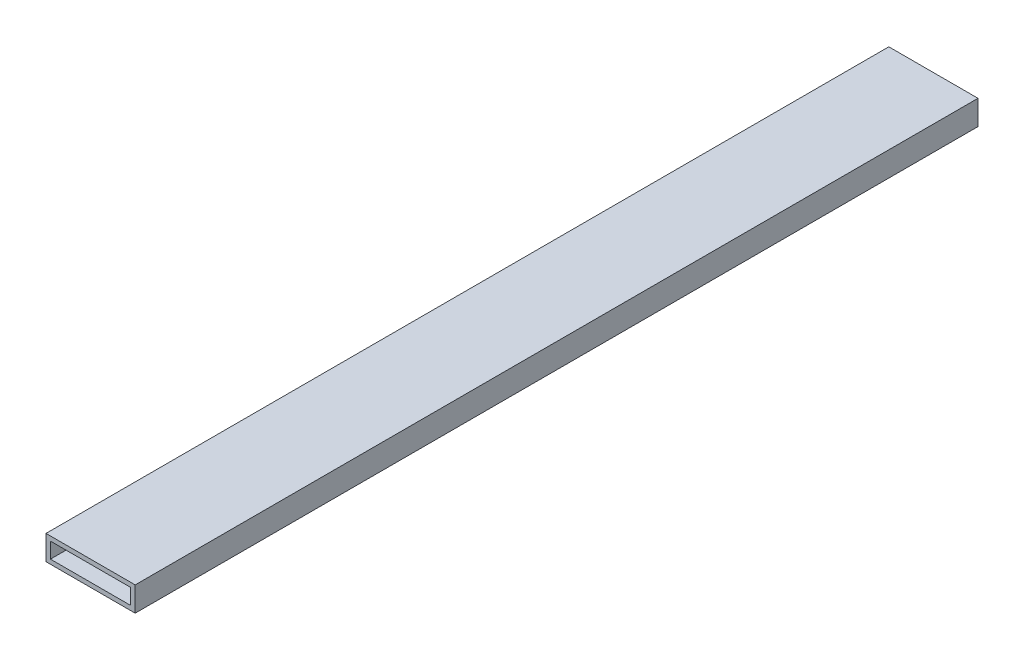
ISO-10303-21;
HEADER;
FILE_DESCRIPTION(('STEP AP214'),'2;1');
FILE_NAME('part.step','',(''),(''),'','','');
FILE_SCHEMA(('AUTOMOTIVE_DESIGN { 1 0 10303 214 1 1 1 1 }'));
ENDSEC;
DATA;
#1=APPLICATION_CONTEXT('core data for automotive mechanical design processes');
#2=APPLICATION_PROTOCOL_DEFINITION('international standard','automotive_design',2000,#1);
#3=PRODUCT_CONTEXT('',#1,'mechanical');
#4=PRODUCT('Part','Part','',(#3));
#5=PRODUCT_RELATED_PRODUCT_CATEGORY('part','',(#4));
#6=PRODUCT_DEFINITION_FORMATION('','',#4);
#7=PRODUCT_DEFINITION_CONTEXT('part definition',#1,'design');
#8=PRODUCT_DEFINITION('design','',#6,#7);
#9=PRODUCT_DEFINITION_SHAPE('','',#8);
#10=(LENGTH_UNIT() NAMED_UNIT(*) SI_UNIT(.MILLI.,.METRE.));
#11=(NAMED_UNIT(*) PLANE_ANGLE_UNIT() SI_UNIT($,.RADIAN.));
#12=(NAMED_UNIT(*) SI_UNIT($,.STERADIAN.) SOLID_ANGLE_UNIT());
#13=UNCERTAINTY_MEASURE_WITH_UNIT(LENGTH_MEASURE(1.E-05),#10,'distance_accuracy_value','');
#14=(GEOMETRIC_REPRESENTATION_CONTEXT(3) GLOBAL_UNCERTAINTY_ASSIGNED_CONTEXT((#13)) GLOBAL_UNIT_ASSIGNED_CONTEXT((#10,
#11,#12)) REPRESENTATION_CONTEXT('',''));
#15=CARTESIAN_POINT('',(0.,0.,0.));
#16=DIRECTION('',(0.,0.,1.));
#17=DIRECTION('',(1.,0.,0.));
#18=AXIS2_PLACEMENT_3D('',#15,#16,#17);
#19=CARTESIAN_POINT('',(0.,0.,378.));
#20=DIRECTION('',(0.,0.,-1.));
#21=DIRECTION('',(-1.,0.,0.));
#22=AXIS2_PLACEMENT_3D('',#19,#20,#21);
#23=PLANE('',#22);
#24=DIRECTION('',(0.,1.,0.));
#25=VECTOR('',#24,1.);
#26=CARTESIAN_POINT('',(20.,-5.5,378.));
#27=LINE('',#26,#25);
#28=CARTESIAN_POINT('',(20.,-5.5,378.));
#29=VERTEX_POINT('',#28);
#30=CARTESIAN_POINT('',(20.,5.5,378.));
#31=VERTEX_POINT('',#30);
#32=EDGE_CURVE('E153',#29,#31,#27,.T.);
#33=ORIENTED_EDGE('',*,*,#32,.T.);
#34=DIRECTION('',(-1.,0.,0.));
#35=VECTOR('',#34,1.);
#36=CARTESIAN_POINT('',(-20.,5.5,378.));
#37=LINE('',#36,#35);
#38=CARTESIAN_POINT('',(-20.,5.5,378.));
#39=VERTEX_POINT('',#38);
#40=EDGE_CURVE('E157',#31,#39,#37,.T.);
#41=ORIENTED_EDGE('',*,*,#40,.T.);
#42=DIRECTION('',(0.,-1.,0.));
#43=VECTOR('',#42,1.);
#44=CARTESIAN_POINT('',(-20.,-5.5,378.));
#45=LINE('',#44,#43);
#46=CARTESIAN_POINT('',(-20.,-5.5,378.));
#47=VERTEX_POINT('',#46);
#48=EDGE_CURVE('E161',#39,#47,#45,.T.);
#49=ORIENTED_EDGE('',*,*,#48,.T.);
#50=DIRECTION('',(1.,0.,0.));
#51=VECTOR('',#50,1.);
#52=CARTESIAN_POINT('',(-20.,-5.5,378.));
#53=LINE('',#52,#51);
#54=EDGE_CURVE('E164',#47,#29,#53,.T.);
#55=ORIENTED_EDGE('',*,*,#54,.T.);
#56=EDGE_LOOP('',(#33,#41,#49,#55));
#57=FACE_BOUND('',#56,.T.);
#58=DIRECTION('',(0.,-1.,0.));
#59=VECTOR('',#58,1.);
#60=CARTESIAN_POINT('',(-18.,-3.5,378.));
#61=LINE('',#60,#59);
#62=CARTESIAN_POINT('',(-18.,3.5,378.));
#63=VERTEX_POINT('',#62);
#64=CARTESIAN_POINT('',(-18.,-3.5,378.));
#65=VERTEX_POINT('',#64);
#66=EDGE_CURVE('E105',#63,#65,#61,.T.);
#67=ORIENTED_EDGE('',*,*,#66,.F.);
#68=DIRECTION('',(-1.,0.,0.));
#69=VECTOR('',#68,1.);
#70=CARTESIAN_POINT('',(-18.,3.5,378.));
#71=LINE('',#70,#69);
#72=CARTESIAN_POINT('',(18.,3.5,378.));
#73=VERTEX_POINT('',#72);
#74=EDGE_CURVE('E131',#73,#63,#71,.T.);
#75=ORIENTED_EDGE('',*,*,#74,.F.);
#76=DIRECTION('',(0.,1.,0.));
#77=VECTOR('',#76,1.);
#78=CARTESIAN_POINT('',(18.,-3.5,378.));
#79=LINE('',#78,#77);
#80=CARTESIAN_POINT('',(18.,-3.5,378.));
#81=VERTEX_POINT('',#80);
#82=EDGE_CURVE('E127',#81,#73,#79,.T.);
#83=ORIENTED_EDGE('',*,*,#82,.F.);
#84=DIRECTION('',(1.,0.,0.));
#85=VECTOR('',#84,1.);
#86=CARTESIAN_POINT('',(-18.,-3.5,378.));
#87=LINE('',#86,#85);
#88=EDGE_CURVE('E114',#65,#81,#87,.T.);
#89=ORIENTED_EDGE('',*,*,#88,.F.);
#90=EDGE_LOOP('',(#67,#75,#83,#89));
#91=FACE_BOUND('',#90,.T.);
#92=ADVANCED_FACE('F39',(#57,#91),#23,.F.);
#93=CARTESIAN_POINT('',(0.,0.,0.));
#94=DIRECTION('',(0.,0.,-1.));
#95=DIRECTION('',(-1.,0.,0.));
#96=AXIS2_PLACEMENT_3D('',#93,#94,#95);
#97=PLANE('',#96);
#98=DIRECTION('',(0.,1.,0.));
#99=VECTOR('',#98,1.);
#100=CARTESIAN_POINT('',(20.,-5.5,0.));
#101=LINE('',#100,#99);
#102=CARTESIAN_POINT('',(20.,-5.5,0.));
#103=VERTEX_POINT('',#102);
#104=CARTESIAN_POINT('',(20.,5.5,0.));
#105=VERTEX_POINT('',#104);
#106=EDGE_CURVE('E123',#103,#105,#101,.T.);
#107=ORIENTED_EDGE('',*,*,#106,.F.);
#108=DIRECTION('',(1.,0.,0.));
#109=VECTOR('',#108,1.);
#110=CARTESIAN_POINT('',(-20.,-5.5,0.));
#111=LINE('',#110,#109);
#112=CARTESIAN_POINT('',(-20.,-5.5,0.));
#113=VERTEX_POINT('',#112);
#114=EDGE_CURVE('E158',#113,#103,#111,.T.);
#115=ORIENTED_EDGE('',*,*,#114,.F.);
#116=DIRECTION('',(0.,-1.,0.));
#117=VECTOR('',#116,1.);
#118=CARTESIAN_POINT('',(-20.,-5.5,0.));
#119=LINE('',#118,#117);
#120=CARTESIAN_POINT('',(-20.,5.5,0.));
#121=VERTEX_POINT('',#120);
#122=EDGE_CURVE('E174',#121,#113,#119,.T.);
#123=ORIENTED_EDGE('',*,*,#122,.F.);
#124=DIRECTION('',(-1.,0.,0.));
#125=VECTOR('',#124,1.);
#126=CARTESIAN_POINT('',(-20.,5.5,0.));
#127=LINE('',#126,#125);
#128=EDGE_CURVE('E171',#105,#121,#127,.T.);
#129=ORIENTED_EDGE('',*,*,#128,.F.);
#130=EDGE_LOOP('',(#107,#115,#123,#129));
#131=FACE_BOUND('',#130,.T.);
#132=DIRECTION('',(-1.,0.,0.));
#133=VECTOR('',#132,1.);
#134=CARTESIAN_POINT('',(-18.,3.5,0.));
#135=LINE('',#134,#133);
#136=CARTESIAN_POINT('',(18.,3.5,0.));
#137=VERTEX_POINT('',#136);
#138=CARTESIAN_POINT('',(-18.,3.5,0.));
#139=VERTEX_POINT('',#138);
#140=EDGE_CURVE('E115',#137,#139,#135,.T.);
#141=ORIENTED_EDGE('',*,*,#140,.T.);
#142=DIRECTION('',(0.,-1.,0.));
#143=VECTOR('',#142,1.);
#144=CARTESIAN_POINT('',(-18.,-3.5,0.));
#145=LINE('',#144,#143);
#146=CARTESIAN_POINT('',(-18.,-3.5,0.));
#147=VERTEX_POINT('',#146);
#148=EDGE_CURVE('E63',#139,#147,#145,.T.);
#149=ORIENTED_EDGE('',*,*,#148,.T.);
#150=DIRECTION('',(1.,0.,0.));
#151=VECTOR('',#150,1.);
#152=CARTESIAN_POINT('',(-18.,-3.5,0.));
#153=LINE('',#152,#151);
#154=CARTESIAN_POINT('',(18.,-3.5,0.));
#155=VERTEX_POINT('',#154);
#156=EDGE_CURVE('E121',#147,#155,#153,.T.);
#157=ORIENTED_EDGE('',*,*,#156,.T.);
#158=DIRECTION('',(0.,1.,0.));
#159=VECTOR('',#158,1.);
#160=CARTESIAN_POINT('',(18.,-3.5,0.));
#161=LINE('',#160,#159);
#162=EDGE_CURVE('E140',#155,#137,#161,.T.);
#163=ORIENTED_EDGE('',*,*,#162,.T.);
#164=EDGE_LOOP('',(#141,#149,#157,#163));
#165=FACE_BOUND('',#164,.T.);
#166=ADVANCED_FACE('F197',(#131,#165),#97,.T.);
#167=CARTESIAN_POINT('',(20.,-5.5,378.));
#168=DIRECTION('',(-1.,0.,0.));
#169=DIRECTION('',(0.,0.,1.));
#170=AXIS2_PLACEMENT_3D('',#167,#168,#169);
#171=PLANE('',#170);
#172=ORIENTED_EDGE('',*,*,#106,.T.);
#173=DIRECTION('',(0.,0.,-1.));
#174=VECTOR('',#173,1.);
#175=CARTESIAN_POINT('',(20.,5.5,378.));
#176=LINE('',#175,#174);
#177=EDGE_CURVE('E11',#31,#105,#176,.T.);
#178=ORIENTED_EDGE('',*,*,#177,.F.);
#179=ORIENTED_EDGE('',*,*,#32,.F.);
#180=DIRECTION('',(0.,0.,-1.));
#181=VECTOR('',#180,1.);
#182=CARTESIAN_POINT('',(20.,-5.5,378.));
#183=LINE('',#182,#181);
#184=EDGE_CURVE('E167',#29,#103,#183,.T.);
#185=ORIENTED_EDGE('',*,*,#184,.T.);
#186=EDGE_LOOP('',(#172,#178,#179,#185));
#187=FACE_BOUND('',#186,.T.);
#188=ADVANCED_FACE('F41',(#187),#171,.F.);
#189=CARTESIAN_POINT('',(-20.,5.5,378.));
#190=DIRECTION('',(0.,-1.,0.));
#191=DIRECTION('',(0.,0.,-1.));
#192=AXIS2_PLACEMENT_3D('',#189,#190,#191);
#193=PLANE('',#192);
#194=ORIENTED_EDGE('',*,*,#128,.T.);
#195=DIRECTION('',(0.,0.,-1.));
#196=VECTOR('',#195,1.);
#197=CARTESIAN_POINT('',(-20.,5.5,378.));
#198=LINE('',#197,#196);
#199=EDGE_CURVE('E48',#39,#121,#198,.T.);
#200=ORIENTED_EDGE('',*,*,#199,.F.);
#201=ORIENTED_EDGE('',*,*,#40,.F.);
#202=ORIENTED_EDGE('',*,*,#177,.T.);
#203=EDGE_LOOP('',(#194,#200,#201,#202));
#204=FACE_BOUND('',#203,.T.);
#205=ADVANCED_FACE('F207',(#204),#193,.F.);
#206=CARTESIAN_POINT('',(-20.,-5.5,378.));
#207=DIRECTION('',(1.,0.,0.));
#208=DIRECTION('',(0.,0.,-1.));
#209=AXIS2_PLACEMENT_3D('',#206,#207,#208);
#210=PLANE('',#209);
#211=ORIENTED_EDGE('',*,*,#122,.T.);
#212=DIRECTION('',(0.,0.,-1.));
#213=VECTOR('',#212,1.);
#214=CARTESIAN_POINT('',(-20.,-5.5,378.));
#215=LINE('',#214,#213);
#216=EDGE_CURVE('E182',#47,#113,#215,.T.);
#217=ORIENTED_EDGE('',*,*,#216,.F.);
#218=ORIENTED_EDGE('',*,*,#48,.F.);
#219=ORIENTED_EDGE('',*,*,#199,.T.);
#220=EDGE_LOOP('',(#211,#217,#218,#219));
#221=FACE_BOUND('',#220,.T.);
#222=ADVANCED_FACE('F191',(#221),#210,.F.);
#223=CARTESIAN_POINT('',(-20.,-5.5,378.));
#224=DIRECTION('',(0.,1.,0.));
#225=DIRECTION('',(0.,0.,1.));
#226=AXIS2_PLACEMENT_3D('',#223,#224,#225);
#227=PLANE('',#226);
#228=ORIENTED_EDGE('',*,*,#114,.T.);
#229=ORIENTED_EDGE('',*,*,#184,.F.);
#230=ORIENTED_EDGE('',*,*,#54,.F.);
#231=ORIENTED_EDGE('',*,*,#216,.T.);
#232=EDGE_LOOP('',(#228,#229,#230,#231));
#233=FACE_BOUND('',#232,.T.);
#234=ADVANCED_FACE('F201',(#233),#227,.F.);
#235=CARTESIAN_POINT('',(-18.,-3.5,378.));
#236=DIRECTION('',(1.,0.,0.));
#237=DIRECTION('',(0.,0.,-1.));
#238=AXIS2_PLACEMENT_3D('',#235,#236,#237);
#239=PLANE('',#238);
#240=ORIENTED_EDGE('',*,*,#148,.F.);
#241=DIRECTION('',(0.,0.,-1.));
#242=VECTOR('',#241,1.);
#243=CARTESIAN_POINT('',(-18.,3.5,378.));
#244=LINE('',#243,#242);
#245=EDGE_CURVE('E109',#63,#139,#244,.T.);
#246=ORIENTED_EDGE('',*,*,#245,.F.);
#247=ORIENTED_EDGE('',*,*,#66,.T.);
#248=DIRECTION('',(0.,0.,-1.));
#249=VECTOR('',#248,1.);
#250=CARTESIAN_POINT('',(-18.,-3.5,378.));
#251=LINE('',#250,#249);
#252=EDGE_CURVE('E108',#65,#147,#251,.T.);
#253=ORIENTED_EDGE('',*,*,#252,.T.);
#254=EDGE_LOOP('',(#240,#246,#247,#253));
#255=FACE_BOUND('',#254,.T.);
#256=ADVANCED_FACE('F107',(#255),#239,.T.);
#257=CARTESIAN_POINT('',(-18.,-3.5,378.));
#258=DIRECTION('',(0.,1.,0.));
#259=DIRECTION('',(0.,0.,1.));
#260=AXIS2_PLACEMENT_3D('',#257,#258,#259);
#261=PLANE('',#260);
#262=ORIENTED_EDGE('',*,*,#156,.F.);
#263=ORIENTED_EDGE('',*,*,#252,.F.);
#264=ORIENTED_EDGE('',*,*,#88,.T.);
#265=DIRECTION('',(0.,0.,-1.));
#266=VECTOR('',#265,1.);
#267=CARTESIAN_POINT('',(18.,-3.5,378.));
#268=LINE('',#267,#266);
#269=EDGE_CURVE('E124',#81,#155,#268,.T.);
#270=ORIENTED_EDGE('',*,*,#269,.T.);
#271=EDGE_LOOP('',(#262,#263,#264,#270));
#272=FACE_BOUND('',#271,.T.);
#273=ADVANCED_FACE('F118',(#272),#261,.T.);
#274=CARTESIAN_POINT('',(18.,-3.5,378.));
#275=DIRECTION('',(-1.,0.,0.));
#276=DIRECTION('',(0.,-1.,0.));
#277=AXIS2_PLACEMENT_3D('',#274,#275,#276);
#278=PLANE('',#277);
#279=ORIENTED_EDGE('',*,*,#162,.F.);
#280=ORIENTED_EDGE('',*,*,#269,.F.);
#281=ORIENTED_EDGE('',*,*,#82,.T.);
#282=DIRECTION('',(0.,0.,-1.));
#283=VECTOR('',#282,1.);
#284=CARTESIAN_POINT('',(18.,3.5,378.));
#285=LINE('',#284,#283);
#286=EDGE_CURVE('E55',#73,#137,#285,.T.);
#287=ORIENTED_EDGE('',*,*,#286,.T.);
#288=EDGE_LOOP('',(#279,#280,#281,#287));
#289=FACE_BOUND('',#288,.T.);
#290=ADVANCED_FACE('F230',(#289),#278,.T.);
#291=CARTESIAN_POINT('',(-18.,3.5,378.));
#292=DIRECTION('',(0.,-1.,0.));
#293=DIRECTION('',(0.,0.,-1.));
#294=AXIS2_PLACEMENT_3D('',#291,#292,#293);
#295=PLANE('',#294);
#296=ORIENTED_EDGE('',*,*,#140,.F.);
#297=ORIENTED_EDGE('',*,*,#286,.F.);
#298=ORIENTED_EDGE('',*,*,#74,.T.);
#299=ORIENTED_EDGE('',*,*,#245,.T.);
#300=EDGE_LOOP('',(#296,#297,#298,#299));
#301=FACE_BOUND('',#300,.T.);
#302=ADVANCED_FACE('F234',(#301),#295,.T.);
#303=CLOSED_SHELL('',(#92,#166,#188,#205,#222,#234,#256,#273,#290,#302));
#304=MANIFOLD_SOLID_BREP('B2',#303);
#305=ADVANCED_BREP_SHAPE_REPRESENTATION('',(#18,#304),#14);
#306=SHAPE_DEFINITION_REPRESENTATION(#9,#305);
ENDSEC;
END-ISO-10303-21;
